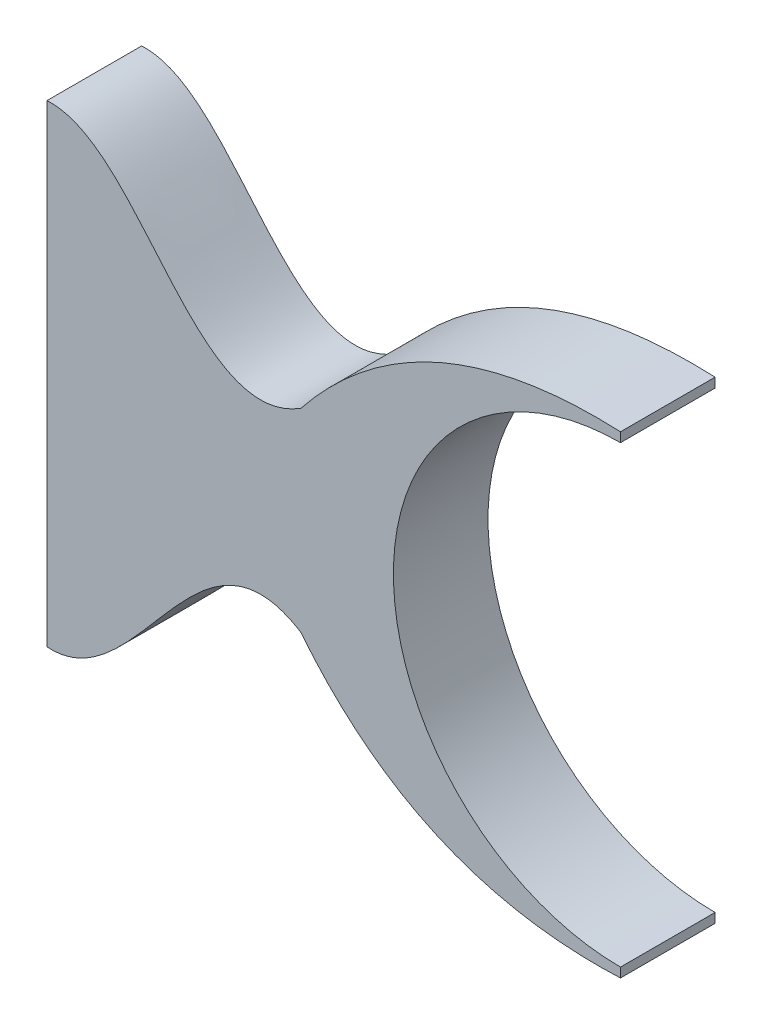
ISO-10303-21;
HEADER;
FILE_DESCRIPTION(('STEP AP214'),'2;1');
FILE_NAME('part.step','',(''),(''),'','','');
FILE_SCHEMA(('AUTOMOTIVE_DESIGN { 1 0 10303 214 1 1 1 1 }'));
ENDSEC;
DATA;
#1=APPLICATION_CONTEXT('core data for automotive mechanical design processes');
#2=APPLICATION_PROTOCOL_DEFINITION('international standard','automotive_design',2000,#1);
#3=PRODUCT_CONTEXT('',#1,'mechanical');
#4=PRODUCT('Part','Part','',(#3));
#5=PRODUCT_RELATED_PRODUCT_CATEGORY('part','',(#4));
#6=PRODUCT_DEFINITION_FORMATION('','',#4);
#7=PRODUCT_DEFINITION_CONTEXT('part definition',#1,'design');
#8=PRODUCT_DEFINITION('design','',#6,#7);
#9=PRODUCT_DEFINITION_SHAPE('','',#8);
#10=(LENGTH_UNIT() NAMED_UNIT(*) SI_UNIT(.MILLI.,.METRE.));
#11=(NAMED_UNIT(*) PLANE_ANGLE_UNIT() SI_UNIT($,.RADIAN.));
#12=(NAMED_UNIT(*) SI_UNIT($,.STERADIAN.) SOLID_ANGLE_UNIT());
#13=UNCERTAINTY_MEASURE_WITH_UNIT(LENGTH_MEASURE(1.E-05),#10,'distance_accuracy_value','');
#14=(GEOMETRIC_REPRESENTATION_CONTEXT(3) GLOBAL_UNCERTAINTY_ASSIGNED_CONTEXT((#13)) GLOBAL_UNIT_ASSIGNED_CONTEXT((#10,
#11,#12)) REPRESENTATION_CONTEXT('',''));
#15=CARTESIAN_POINT('',(0.,0.,0.));
#16=DIRECTION('',(0.,0.,1.));
#17=DIRECTION('',(1.,0.,0.));
#18=AXIS2_PLACEMENT_3D('',#15,#16,#17);
#19=CARTESIAN_POINT('',(0.,2.5,1.));
#20=CARTESIAN_POINT('',(-2.12838134377981,2.59606487465497,1.));
#21=CARTESIAN_POINT('',(-3.3783144735857,1.02555953711763,1.));
#22=B_SPLINE_CURVE_WITH_KNOTS('',2,(#19,#20,#21),.UNSPECIFIED.,.F.,.F.,(3,3),(0.,1.),.UNSPECIFIED.);
#23=DIRECTION('',(0.,0.,-1.));
#24=VECTOR('',#23,1.);
#25=SURFACE_OF_LINEAR_EXTRUSION('',#22,#24);
#26=CARTESIAN_POINT('',(0.,2.5,0.));
#27=CARTESIAN_POINT('',(-2.12838134377981,2.59606487465497,0.));
#28=CARTESIAN_POINT('',(-3.3783144735857,1.02555953711763,0.));
#29=B_SPLINE_CURVE_WITH_KNOTS('',2,(#26,#27,#28),.UNSPECIFIED.,.F.,.F.,(3,3),(0.,1.),.UNSPECIFIED.);
#30=CARTESIAN_POINT('',(0.,2.5,0.));
#31=VERTEX_POINT('',#30);
#32=CARTESIAN_POINT('',(-3.3783144735857,1.02555953711763,0.));
#33=VERTEX_POINT('',#32);
#34=EDGE_CURVE('E132',#31,#33,#29,.T.);
#35=ORIENTED_EDGE('',*,*,#34,.T.);
#36=DIRECTION('',(0.,0.,-1.));
#37=VECTOR('',#36,1.);
#38=CARTESIAN_POINT('',(-3.3783144735857,1.02555953711763,1.));
#39=LINE('',#38,#37);
#40=CARTESIAN_POINT('',(-3.3783144735857,1.02555953711763,1.));
#41=VERTEX_POINT('',#40);
#42=EDGE_CURVE('E11',#41,#33,#39,.T.);
#43=ORIENTED_EDGE('',*,*,#42,.F.);
#44=CARTESIAN_POINT('',(0.,2.5,1.));
#45=VERTEX_POINT('',#44);
#46=EDGE_CURVE('E166',#45,#41,#22,.T.);
#47=ORIENTED_EDGE('',*,*,#46,.F.);
#48=DIRECTION('',(0.,0.,-1.));
#49=VECTOR('',#48,1.);
#50=CARTESIAN_POINT('',(0.,2.5,1.));
#51=LINE('',#50,#49);
#52=EDGE_CURVE('E128',#45,#31,#51,.T.);
#53=ORIENTED_EDGE('',*,*,#52,.T.);
#54=EDGE_LOOP('',(#35,#43,#47,#53));
#55=FACE_BOUND('',#54,.T.);
#56=ADVANCED_FACE('F35',(#55),#25,.F.);
#57=CARTESIAN_POINT('',(-3.3783144735857,1.02555953711763,1.));
#58=CARTESIAN_POINT('',(-4.49216767972878,0.325238313772212,1.));
#59=CARTESIAN_POINT('',(-5.08246023541055,2.56845581459525,1.));
#60=CARTESIAN_POINT('',(-6.0625522393459,2.5,1.));
#61=B_SPLINE_CURVE_WITH_KNOTS('',3,(#57,#58,#59,#60),.UNSPECIFIED.,.F.,.F.,(4,4),(0.,1.),.UNSPECIFIED.);
#62=DIRECTION('',(0.,0.,-1.));
#63=VECTOR('',#62,1.);
#64=SURFACE_OF_LINEAR_EXTRUSION('',#61,#63);
#65=CARTESIAN_POINT('',(-3.3783144735857,1.02555953711763,0.));
#66=CARTESIAN_POINT('',(-4.49216767972878,0.325238313772212,0.));
#67=CARTESIAN_POINT('',(-5.08246023541055,2.56845581459525,0.));
#68=CARTESIAN_POINT('',(-6.0625522393459,2.5,0.));
#69=B_SPLINE_CURVE_WITH_KNOTS('',3,(#65,#66,#67,#68),.UNSPECIFIED.,.F.,.F.,(4,4),(0.,1.),.UNSPECIFIED.);
#70=CARTESIAN_POINT('',(-6.0625522393459,2.5,0.));
#71=VERTEX_POINT('',#70);
#72=EDGE_CURVE('E137',#33,#71,#69,.T.);
#73=ORIENTED_EDGE('',*,*,#72,.T.);
#74=DIRECTION('',(0.,0.,-1.));
#75=VECTOR('',#74,1.);
#76=CARTESIAN_POINT('',(-6.0625522393459,2.5,1.));
#77=LINE('',#76,#75);
#78=CARTESIAN_POINT('',(-6.0625522393459,2.5,1.));
#79=VERTEX_POINT('',#78);
#80=EDGE_CURVE('E44',#79,#71,#77,.T.);
#81=ORIENTED_EDGE('',*,*,#80,.F.);
#82=EDGE_CURVE('E95',#41,#79,#61,.T.);
#83=ORIENTED_EDGE('',*,*,#82,.F.);
#84=ORIENTED_EDGE('',*,*,#42,.T.);
#85=EDGE_LOOP('',(#73,#81,#83,#84));
#86=FACE_BOUND('',#85,.T.);
#87=ADVANCED_FACE('F213',(#86),#64,.F.);
#88=CARTESIAN_POINT('',(-6.0625522393459,2.5,1.));
#89=DIRECTION('',(1.,0.,0.));
#90=DIRECTION('',(0.,0.,-1.));
#91=AXIS2_PLACEMENT_3D('',#88,#89,#90);
#92=PLANE('',#91);
#93=DIRECTION('',(0.,-1.,0.));
#94=VECTOR('',#93,1.);
#95=CARTESIAN_POINT('',(-6.0625522393459,2.5,0.));
#96=LINE('',#95,#94);
#97=CARTESIAN_POINT('',(-6.0625522393459,-2.5,0.));
#98=VERTEX_POINT('',#97);
#99=EDGE_CURVE('E144',#71,#98,#96,.T.);
#100=ORIENTED_EDGE('',*,*,#99,.T.);
#101=DIRECTION('',(0.,0.,-1.));
#102=VECTOR('',#101,1.);
#103=CARTESIAN_POINT('',(-6.0625522393459,-2.5,1.));
#104=LINE('',#103,#102);
#105=CARTESIAN_POINT('',(-6.0625522393459,-2.5,1.));
#106=VERTEX_POINT('',#105);
#107=EDGE_CURVE('E173',#106,#98,#104,.T.);
#108=ORIENTED_EDGE('',*,*,#107,.F.);
#109=DIRECTION('',(0.,-1.,0.));
#110=VECTOR('',#109,1.);
#111=CARTESIAN_POINT('',(-6.0625522393459,2.5,1.));
#112=LINE('',#111,#110);
#113=EDGE_CURVE('E181',#79,#106,#112,.T.);
#114=ORIENTED_EDGE('',*,*,#113,.F.);
#115=ORIENTED_EDGE('',*,*,#80,.T.);
#116=EDGE_LOOP('',(#100,#108,#114,#115));
#117=FACE_BOUND('',#116,.T.);
#118=ADVANCED_FACE('F179',(#117),#92,.F.);
#119=CARTESIAN_POINT('',(-6.0625522393459,-2.5,1.));
#120=CARTESIAN_POINT('',(-5.08246023541055,-2.56845581459525,1.));
#121=CARTESIAN_POINT('',(-4.49216767972878,-0.325238313772213,1.));
#122=CARTESIAN_POINT('',(-3.3783144735857,-1.02555953711763,1.));
#123=B_SPLINE_CURVE_WITH_KNOTS('',3,(#119,#120,#121,#122),.UNSPECIFIED.,.F.,.F.,(4,4),(0.,1.),.UNSPECIFIED.);
#124=DIRECTION('',(0.,0.,-1.));
#125=VECTOR('',#124,1.);
#126=SURFACE_OF_LINEAR_EXTRUSION('',#123,#125);
#127=CARTESIAN_POINT('',(-6.0625522393459,-2.5,0.));
#128=CARTESIAN_POINT('',(-5.08246023541055,-2.56845581459525,0.));
#129=CARTESIAN_POINT('',(-4.49216767972878,-0.325238313772213,0.));
#130=CARTESIAN_POINT('',(-3.3783144735857,-1.02555953711763,0.));
#131=B_SPLINE_CURVE_WITH_KNOTS('',3,(#127,#128,#129,#130),.UNSPECIFIED.,.F.,.F.,(4,4),(0.,1.),.UNSPECIFIED.);
#132=CARTESIAN_POINT('',(-3.3783144735857,-1.02555953711763,0.));
#133=VERTEX_POINT('',#132);
#134=EDGE_CURVE('E149',#98,#133,#131,.T.);
#135=ORIENTED_EDGE('',*,*,#134,.T.);
#136=DIRECTION('',(0.,0.,-1.));
#137=VECTOR('',#136,1.);
#138=CARTESIAN_POINT('',(-3.3783144735857,-1.02555953711763,1.));
#139=LINE('',#138,#137);
#140=CARTESIAN_POINT('',(-3.3783144735857,-1.02555953711763,1.));
#141=VERTEX_POINT('',#140);
#142=EDGE_CURVE('E170',#141,#133,#139,.T.);
#143=ORIENTED_EDGE('',*,*,#142,.F.);
#144=EDGE_CURVE('E193',#106,#141,#123,.T.);
#145=ORIENTED_EDGE('',*,*,#144,.F.);
#146=ORIENTED_EDGE('',*,*,#107,.T.);
#147=EDGE_LOOP('',(#135,#143,#145,#146));
#148=FACE_BOUND('',#147,.T.);
#149=ADVANCED_FACE('F189',(#148),#126,.F.);
#150=CARTESIAN_POINT('',(-3.3783144735857,-1.02555953711763,1.));
#151=CARTESIAN_POINT('',(-2.12838134377981,-2.59606487465497,1.));
#152=CARTESIAN_POINT('',(0.,-2.5,1.));
#153=B_SPLINE_CURVE_WITH_KNOTS('',2,(#150,#151,#152),.UNSPECIFIED.,.F.,.F.,(3,3),(0.,1.),.UNSPECIFIED.);
#154=DIRECTION('',(0.,0.,-1.));
#155=VECTOR('',#154,1.);
#156=SURFACE_OF_LINEAR_EXTRUSION('',#153,#155);
#157=CARTESIAN_POINT('',(-3.3783144735857,-1.02555953711763,0.));
#158=CARTESIAN_POINT('',(-2.12838134377981,-2.59606487465497,0.));
#159=CARTESIAN_POINT('',(0.,-2.5,0.));
#160=B_SPLINE_CURVE_WITH_KNOTS('',2,(#157,#158,#159),.UNSPECIFIED.,.F.,.F.,(3,3),(0.,1.),.UNSPECIFIED.);
#161=CARTESIAN_POINT('',(0.,-2.5,0.));
#162=VERTEX_POINT('',#161);
#163=EDGE_CURVE('E153',#133,#162,#160,.T.);
#164=ORIENTED_EDGE('',*,*,#163,.T.);
#165=DIRECTION('',(0.,0.,-1.));
#166=VECTOR('',#165,1.);
#167=CARTESIAN_POINT('',(0.,-2.5,1.));
#168=LINE('',#167,#166);
#169=CARTESIAN_POINT('',(0.,-2.5,1.));
#170=VERTEX_POINT('',#169);
#171=EDGE_CURVE('E123',#170,#162,#168,.T.);
#172=ORIENTED_EDGE('',*,*,#171,.F.);
#173=EDGE_CURVE('E114',#141,#170,#153,.T.);
#174=ORIENTED_EDGE('',*,*,#173,.F.);
#175=ORIENTED_EDGE('',*,*,#142,.T.);
#176=EDGE_LOOP('',(#164,#172,#174,#175));
#177=FACE_BOUND('',#176,.T.);
#178=ADVANCED_FACE('F192',(#177),#156,.F.);
#179=CARTESIAN_POINT('',(0.,-2.5,1.));
#180=DIRECTION('',(-1.,0.,0.));
#181=DIRECTION('',(0.,0.,1.));
#182=AXIS2_PLACEMENT_3D('',#179,#180,#181);
#183=PLANE('',#182);
#184=DIRECTION('',(0.,1.,0.));
#185=VECTOR('',#184,1.);
#186=CARTESIAN_POINT('',(0.,-2.5,0.));
#187=LINE('',#186,#185);
#188=CARTESIAN_POINT('',(0.,-2.4,0.));
#189=VERTEX_POINT('',#188);
#190=EDGE_CURVE('E122',#162,#189,#187,.T.);
#191=ORIENTED_EDGE('',*,*,#190,.T.);
#192=DIRECTION('',(0.,0.,-1.));
#193=VECTOR('',#192,1.);
#194=CARTESIAN_POINT('',(0.,-2.4,1.));
#195=LINE('',#194,#193);
#196=CARTESIAN_POINT('',(0.,-2.4,1.));
#197=VERTEX_POINT('',#196);
#198=EDGE_CURVE('E119',#197,#189,#195,.T.);
#199=ORIENTED_EDGE('',*,*,#198,.F.);
#200=DIRECTION('',(0.,1.,0.));
#201=VECTOR('',#200,1.);
#202=CARTESIAN_POINT('',(0.,-2.5,1.));
#203=LINE('',#202,#201);
#204=EDGE_CURVE('E108',#170,#197,#203,.T.);
#205=ORIENTED_EDGE('',*,*,#204,.F.);
#206=ORIENTED_EDGE('',*,*,#171,.T.);
#207=EDGE_LOOP('',(#191,#199,#205,#206));
#208=FACE_BOUND('',#207,.T.);
#209=ADVANCED_FACE('F120',(#208),#183,.F.);
#210=CARTESIAN_POINT('',(0.,0.,1.));
#211=DIRECTION('',(0.,0.,-1.));
#212=DIRECTION('',(-1.,0.,0.));
#213=AXIS2_PLACEMENT_3D('',#210,#211,#212);
#214=CYLINDRICAL_SURFACE('',#213,2.4);
#215=CARTESIAN_POINT('',(0.,0.,0.));
#216=DIRECTION('',(0.,0.,-1.));
#217=DIRECTION('',(1.,0.,0.));
#218=AXIS2_PLACEMENT_3D('',#215,#216,#217);
#219=CIRCLE('',#218,2.4);
#220=CARTESIAN_POINT('',(0.,2.4,0.));
#221=VERTEX_POINT('',#220);
#222=EDGE_CURVE('E81',#189,#221,#219,.T.);
#223=ORIENTED_EDGE('',*,*,#222,.T.);
#224=DIRECTION('',(0.,0.,-1.));
#225=VECTOR('',#224,1.);
#226=CARTESIAN_POINT('',(0.,2.4,1.));
#227=LINE('',#226,#225);
#228=CARTESIAN_POINT('',(0.,2.4,1.));
#229=VERTEX_POINT('',#228);
#230=EDGE_CURVE('E124',#229,#221,#227,.T.);
#231=ORIENTED_EDGE('',*,*,#230,.F.);
#232=CARTESIAN_POINT('',(0.,0.,1.));
#233=DIRECTION('',(0.,0.,-1.));
#234=DIRECTION('',(1.,0.,0.));
#235=AXIS2_PLACEMENT_3D('',#232,#233,#234);
#236=CIRCLE('',#235,2.4);
#237=EDGE_CURVE('E112',#197,#229,#236,.T.);
#238=ORIENTED_EDGE('',*,*,#237,.F.);
#239=ORIENTED_EDGE('',*,*,#198,.T.);
#240=EDGE_LOOP('',(#223,#231,#238,#239));
#241=FACE_BOUND('',#240,.T.);
#242=ADVANCED_FACE('F126',(#241),#214,.F.);
#243=CARTESIAN_POINT('',(0.,2.5,1.));
#244=DIRECTION('',(-1.,0.,0.));
#245=DIRECTION('',(0.,0.,1.));
#246=AXIS2_PLACEMENT_3D('',#243,#244,#245);
#247=PLANE('',#246);
#248=DIRECTION('',(0.,1.,0.));
#249=VECTOR('',#248,1.);
#250=CARTESIAN_POINT('',(0.,2.5,0.));
#251=LINE('',#250,#249);
#252=EDGE_CURVE('E87',#221,#31,#251,.T.);
#253=ORIENTED_EDGE('',*,*,#252,.T.);
#254=ORIENTED_EDGE('',*,*,#52,.F.);
#255=DIRECTION('',(0.,1.,0.));
#256=VECTOR('',#255,1.);
#257=CARTESIAN_POINT('',(0.,2.5,1.));
#258=LINE('',#257,#256);
#259=EDGE_CURVE('E52',#229,#45,#258,.T.);
#260=ORIENTED_EDGE('',*,*,#259,.F.);
#261=ORIENTED_EDGE('',*,*,#230,.T.);
#262=EDGE_LOOP('',(#253,#254,#260,#261));
#263=FACE_BOUND('',#262,.T.);
#264=ADVANCED_FACE('F228',(#263),#247,.F.);
#265=CARTESIAN_POINT('',(-1.90876929028633,2.17942232160689,1.));
#266=DIRECTION('',(0.,0.,-1.));
#267=DIRECTION('',(-1.,0.,0.));
#268=AXIS2_PLACEMENT_3D('',#265,#266,#267);
#269=PLANE('',#268);
#270=ORIENTED_EDGE('',*,*,#46,.T.);
#271=ORIENTED_EDGE('',*,*,#82,.T.);
#272=ORIENTED_EDGE('',*,*,#113,.T.);
#273=ORIENTED_EDGE('',*,*,#144,.T.);
#274=ORIENTED_EDGE('',*,*,#173,.T.);
#275=ORIENTED_EDGE('',*,*,#204,.T.);
#276=ORIENTED_EDGE('',*,*,#237,.T.);
#277=ORIENTED_EDGE('',*,*,#259,.T.);
#278=EDGE_LOOP('',(#270,#271,#272,#273,#274,#275,#276,#277));
#279=FACE_BOUND('',#278,.T.);
#280=ADVANCED_FACE('F110',(#279),#269,.F.);
#281=CARTESIAN_POINT('',(-1.90876929028633,2.17942232160689,0.));
#282=DIRECTION('',(0.,0.,-1.));
#283=DIRECTION('',(-1.,0.,0.));
#284=AXIS2_PLACEMENT_3D('',#281,#282,#283);
#285=PLANE('',#284);
#286=ORIENTED_EDGE('',*,*,#34,.F.);
#287=ORIENTED_EDGE('',*,*,#252,.F.);
#288=ORIENTED_EDGE('',*,*,#222,.F.);
#289=ORIENTED_EDGE('',*,*,#190,.F.);
#290=ORIENTED_EDGE('',*,*,#163,.F.);
#291=ORIENTED_EDGE('',*,*,#134,.F.);
#292=ORIENTED_EDGE('',*,*,#99,.F.);
#293=ORIENTED_EDGE('',*,*,#72,.F.);
#294=EDGE_LOOP('',(#286,#287,#288,#289,#290,#291,#292,#293));
#295=FACE_BOUND('',#294,.T.);
#296=ADVANCED_FACE('F185',(#295),#285,.T.);
#297=CLOSED_SHELL('',(#56,#87,#118,#149,#178,#209,#242,#264,#280,#296));
#298=MANIFOLD_SOLID_BREP('B2',#297);
#299=ADVANCED_BREP_SHAPE_REPRESENTATION('',(#18,#298),#14);
#300=SHAPE_DEFINITION_REPRESENTATION(#9,#299);
ENDSEC;
END-ISO-10303-21;
